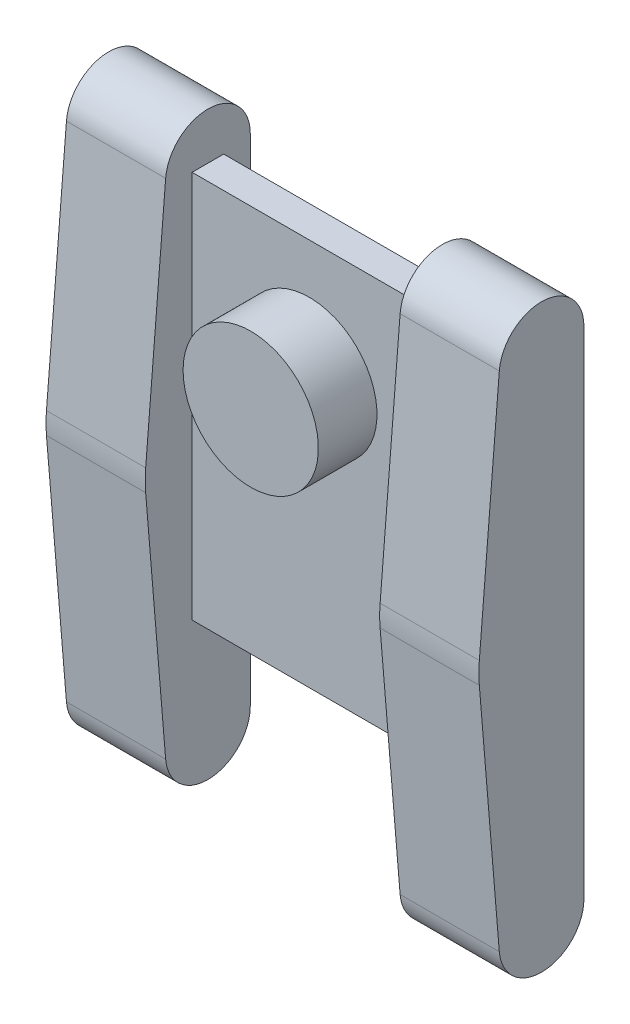
ISO-10303-21;
HEADER;
FILE_DESCRIPTION(('STEP AP214'),'2;1');
FILE_NAME('part.step','',(''),(''),'','','');
FILE_SCHEMA(('AUTOMOTIVE_DESIGN { 1 0 10303 214 1 1 1 1 }'));
ENDSEC;
DATA;
#1=APPLICATION_CONTEXT('core data for automotive mechanical design processes');
#2=APPLICATION_PROTOCOL_DEFINITION('international standard','automotive_design',2000,#1);
#3=PRODUCT_CONTEXT('',#1,'mechanical');
#4=PRODUCT('Part','Part','',(#3));
#5=PRODUCT_RELATED_PRODUCT_CATEGORY('part','',(#4));
#6=PRODUCT_DEFINITION_FORMATION('','',#4);
#7=PRODUCT_DEFINITION_CONTEXT('part definition',#1,'design');
#8=PRODUCT_DEFINITION('design','',#6,#7);
#9=PRODUCT_DEFINITION_SHAPE('','',#8);
#10=(LENGTH_UNIT() NAMED_UNIT(*) SI_UNIT(.MILLI.,.METRE.));
#11=(NAMED_UNIT(*) PLANE_ANGLE_UNIT() SI_UNIT($,.RADIAN.));
#12=(NAMED_UNIT(*) SI_UNIT($,.STERADIAN.) SOLID_ANGLE_UNIT());
#13=UNCERTAINTY_MEASURE_WITH_UNIT(LENGTH_MEASURE(1.E-05),#10,'distance_accuracy_value','');
#14=(GEOMETRIC_REPRESENTATION_CONTEXT(3) GLOBAL_UNCERTAINTY_ASSIGNED_CONTEXT((#13)) GLOBAL_UNIT_ASSIGNED_CONTEXT((#10,
#11,#12)) REPRESENTATION_CONTEXT('',''));
#15=CARTESIAN_POINT('',(0.,0.,0.));
#16=DIRECTION('',(0.,0.,1.));
#17=DIRECTION('',(1.,0.,0.));
#18=AXIS2_PLACEMENT_3D('',#15,#16,#17);
#19=CARTESIAN_POINT('',(2750.,-1600.,-450.));
#20=DIRECTION('',(0.,0.,1.));
#21=DIRECTION('',(1.,0.,0.));
#22=AXIS2_PLACEMENT_3D('',#19,#20,#21);
#23=PLANE('',#22);
#24=CARTESIAN_POINT('',(2000.,-1600.,-450.));
#25=DIRECTION('',(0.,0.,-1.));
#26=DIRECTION('',(-1.,0.,0.));
#27=AXIS2_PLACEMENT_3D('',#24,#25,#26);
#28=CIRCLE('',#27,750.);
#29=CARTESIAN_POINT('',(1250.,-1600.,-450.));
#30=VERTEX_POINT('',#29);
#31=EDGE_CURVE('E19',#30,#30,#28,.T.);
#32=ORIENTED_EDGE('',*,*,#31,.F.);
#33=EDGE_LOOP('',(#32));
#34=FACE_BOUND('',#33,.T.);
#35=ADVANCED_FACE('F16',(#34),#23,.T.);
#36=CARTESIAN_POINT('',(4400.,-250.,-1275.));
#37=DIRECTION('',(-1.,0.,0.));
#38=DIRECTION('',(0.,0.,1.));
#39=AXIS2_PLACEMENT_3D('',#36,#37,#38);
#40=PLANE('',#39);
#41=CARTESIAN_POINT('',(4400.,-3000.00000000002,-2025.00000000002));
#42=DIRECTION('',(-1.,0.,0.));
#43=DIRECTION('',(0.,0.,1.));
#44=AXIS2_PLACEMENT_3D('',#41,#42,#43);
#45=CIRCLE('',#44,1445.00000000002);
#46=CARTESIAN_POINT('',(4400.,-3119.57899022863,-584.956297504861));
#47=VERTEX_POINT('',#46);
#48=CARTESIAN_POINT('',(4400.,-2880.42100977142,-584.95629750486));
#49=VERTEX_POINT('',#48);
#50=EDGE_CURVE('E126',#47,#49,#45,.T.);
#51=ORIENTED_EDGE('',*,*,#50,.F.);
#52=DIRECTION('',(0.,-0.996570036328816,-0.082753626455778));
#53=VECTOR('',#52,1.);
#54=CARTESIAN_POINT('',(4400.,-5788.89420443421,-806.612082925455));
#55=LINE('',#54,#53);
#56=CARTESIAN_POINT('',(4400.,-5788.89420443421,-806.612082925456));
#57=VERTEX_POINT('',#56);
#58=EDGE_CURVE('E132',#57,#47,#55,.F.);
#59=ORIENTED_EDGE('',*,*,#58,.F.);
#60=CARTESIAN_POINT('',(4400.,-5750.,-1275.));
#61=DIRECTION('',(-1.,0.,0.));
#62=DIRECTION('',(0.,0.,1.));
#63=AXIS2_PLACEMENT_3D('',#60,#61,#62);
#64=CIRCLE('',#63,470.000000000001);
#65=CARTESIAN_POINT('',(4400.,-5750.,-1745.));
#66=VERTEX_POINT('',#65);
#67=EDGE_CURVE('E208',#66,#57,#64,.T.);
#68=ORIENTED_EDGE('',*,*,#67,.F.);
#69=DIRECTION('',(0.,1.,0.));
#70=VECTOR('',#69,1.);
#71=CARTESIAN_POINT('',(4400.,-250.,-1745.));
#72=LINE('',#71,#70);
#73=CARTESIAN_POINT('',(4400.,-250.,-1745.));
#74=VERTEX_POINT('',#73);
#75=EDGE_CURVE('E165',#74,#66,#72,.F.);
#76=ORIENTED_EDGE('',*,*,#75,.F.);
#77=CARTESIAN_POINT('',(4400.,-250.,-1275.));
#78=DIRECTION('',(-1.,0.,0.));
#79=DIRECTION('',(0.,0.,1.));
#80=AXIS2_PLACEMENT_3D('',#77,#78,#79);
#81=CIRCLE('',#80,470.);
#82=CARTESIAN_POINT('',(4400.,-211.105795565785,-806.612082925456));
#83=VERTEX_POINT('',#82);
#84=EDGE_CURVE('E210',#83,#74,#81,.T.);
#85=ORIENTED_EDGE('',*,*,#84,.F.);
#86=DIRECTION('',(0.,-0.996570036328816,0.0827536264557768));
#87=VECTOR('',#86,1.);
#88=CARTESIAN_POINT('',(4400.,-3000.00000000002,-575.026644064957));
#89=LINE('',#88,#87);
#90=EDGE_CURVE('E135',#49,#83,#89,.F.);
#91=ORIENTED_EDGE('',*,*,#90,.F.);
#92=EDGE_LOOP('',(#51,#59,#68,#76,#85,#91));
#93=FACE_BOUND('',#92,.T.);
#94=ADVANCED_FACE('F130',(#93),#40,.F.);
#95=CARTESIAN_POINT('',(-400.,-250.,-1275.));
#96=DIRECTION('',(1.,0.,0.));
#97=DIRECTION('',(0.,0.,-1.));
#98=AXIS2_PLACEMENT_3D('',#95,#96,#97);
#99=PLANE('',#98);
#100=CARTESIAN_POINT('',(-400.,-2999.99999999997,-2025.00000000002));
#101=DIRECTION('',(-1.,0.,0.));
#102=DIRECTION('',(0.,0.,1.));
#103=AXIS2_PLACEMENT_3D('',#100,#101,#102);
#104=CIRCLE('',#103,1445.00000000002);
#105=CARTESIAN_POINT('',(-400.,-2880.42100977137,-584.95629750486));
#106=VERTEX_POINT('',#105);
#107=CARTESIAN_POINT('',(-400.,-3119.57899022857,-584.95629750486));
#108=VERTEX_POINT('',#107);
#109=EDGE_CURVE('E163',#106,#108,#104,.F.);
#110=ORIENTED_EDGE('',*,*,#109,.F.);
#111=DIRECTION('',(0.,0.996570036328816,-0.0827536264557781));
#112=VECTOR('',#111,1.);
#113=CARTESIAN_POINT('',(-400.,-211.105795565784,-806.612082925455));
#114=LINE('',#113,#112);
#115=CARTESIAN_POINT('',(-400.,-211.105795565784,-806.612082925456));
#116=VERTEX_POINT('',#115);
#117=EDGE_CURVE('E154',#106,#116,#114,.T.);
#118=ORIENTED_EDGE('',*,*,#117,.T.);
#119=CARTESIAN_POINT('',(-400.,-250.,-1275.));
#120=DIRECTION('',(1.,0.,0.));
#121=DIRECTION('',(0.,0.,-1.));
#122=AXIS2_PLACEMENT_3D('',#119,#120,#121);
#123=CIRCLE('',#122,470.000000000001);
#124=CARTESIAN_POINT('',(-400.,-250.,-1745.));
#125=VERTEX_POINT('',#124);
#126=EDGE_CURVE('E199',#125,#116,#123,.T.);
#127=ORIENTED_EDGE('',*,*,#126,.F.);
#128=DIRECTION('',(0.,1.,0.));
#129=VECTOR('',#128,1.);
#130=CARTESIAN_POINT('',(-400.,0.,-1745.));
#131=LINE('',#130,#129);
#132=CARTESIAN_POINT('',(-400.,-5750.,-1745.));
#133=VERTEX_POINT('',#132);
#134=EDGE_CURVE('E157',#125,#133,#131,.F.);
#135=ORIENTED_EDGE('',*,*,#134,.T.);
#136=CARTESIAN_POINT('',(-400.,-5750.,-1275.));
#137=DIRECTION('',(1.,0.,0.));
#138=DIRECTION('',(0.,0.,-1.));
#139=AXIS2_PLACEMENT_3D('',#136,#137,#138);
#140=CIRCLE('',#139,470.000000000001);
#141=CARTESIAN_POINT('',(-400.,-5788.89420443422,-806.612082925455));
#142=VERTEX_POINT('',#141);
#143=EDGE_CURVE('E160',#142,#133,#140,.T.);
#144=ORIENTED_EDGE('',*,*,#143,.F.);
#145=DIRECTION('',(0.,0.996570036328816,0.0827536264557765));
#146=VECTOR('',#145,1.);
#147=CARTESIAN_POINT('',(-400.,-2999.99999999997,-575.026644064957));
#148=LINE('',#147,#146);
#149=EDGE_CURVE('E161',#142,#108,#148,.T.);
#150=ORIENTED_EDGE('',*,*,#149,.T.);
#151=EDGE_LOOP('',(#110,#118,#127,#135,#144,#150));
#152=FACE_BOUND('',#151,.T.);
#153=ADVANCED_FACE('F348',(#152),#99,.F.);
#154=CARTESIAN_POINT('',(2000.,-1600.,-450.));
#155=DIRECTION('',(0.,0.,-1.));
#156=DIRECTION('',(-1.,0.,0.));
#157=AXIS2_PLACEMENT_3D('',#154,#155,#156);
#158=CYLINDRICAL_SURFACE('',#157,750.);
#159=CARTESIAN_POINT('',(2000.,-1600.,-1100.));
#160=DIRECTION('',(0.,0.,-1.));
#161=DIRECTION('',(-1.,0.,0.));
#162=AXIS2_PLACEMENT_3D('',#159,#160,#161);
#163=CIRCLE('',#162,750.);
#164=CARTESIAN_POINT('',(1250.,-1600.,-1100.));
#165=VERTEX_POINT('',#164);
#166=EDGE_CURVE('E195',#165,#165,#163,.T.);
#167=ORIENTED_EDGE('',*,*,#166,.F.);
#168=EDGE_LOOP('',(#167));
#169=FACE_BOUND('',#168,.T.);
#170=ORIENTED_EDGE('',*,*,#31,.T.);
#171=EDGE_LOOP('',(#170));
#172=FACE_BOUND('',#171,.T.);
#173=ADVANCED_FACE('F353',(#169,#172),#158,.T.);
#174=CARTESIAN_POINT('',(4400.,-5788.89420443421,-806.612082925455));
#175=DIRECTION('',(0.,-0.082753626455778,0.996570036328816));
#176=DIRECTION('',(0.,-0.996570036328816,-0.082753626455778));
#177=AXIS2_PLACEMENT_3D('',#174,#175,#176);
#178=PLANE('',#177);
#179=DIRECTION('',(0.,0.996570036328816,0.0827536264557782));
#180=VECTOR('',#179,1.);
#181=CARTESIAN_POINT('',(3300.,-5788.89420443421,-806.612082925456));
#182=LINE('',#181,#180);
#183=CARTESIAN_POINT('',(3300.,-5788.89420443421,-806.612082925456));
#184=VERTEX_POINT('',#183);
#185=CARTESIAN_POINT('',(3300.,-3119.57899022863,-584.956297504861));
#186=VERTEX_POINT('',#185);
#187=EDGE_CURVE('E194',#184,#186,#182,.T.);
#188=ORIENTED_EDGE('',*,*,#187,.F.);
#189=DIRECTION('',(-1.,0.,0.));
#190=VECTOR('',#189,1.);
#191=CARTESIAN_POINT('',(4400.,-5788.89420443421,-806.612082925456));
#192=LINE('',#191,#190);
#193=EDGE_CURVE('E144',#57,#184,#192,.T.);
#194=ORIENTED_EDGE('',*,*,#193,.F.);
#195=ORIENTED_EDGE('',*,*,#58,.T.);
#196=DIRECTION('',(-1.,0.,0.));
#197=VECTOR('',#196,1.);
#198=CARTESIAN_POINT('',(4400.,-3119.57899022863,-584.956297504861));
#199=LINE('',#198,#197);
#200=EDGE_CURVE('E138',#186,#47,#199,.F.);
#201=ORIENTED_EDGE('',*,*,#200,.F.);
#202=EDGE_LOOP('',(#188,#194,#195,#201));
#203=FACE_BOUND('',#202,.T.);
#204=ADVANCED_FACE('F141',(#203),#178,.T.);
#205=CARTESIAN_POINT('',(4400.,-3000.00000000002,-2025.00000000002));
#206=DIRECTION('',(-1.,0.,0.));
#207=DIRECTION('',(0.,0.,1.));
#208=AXIS2_PLACEMENT_3D('',#205,#206,#207);
#209=CYLINDRICAL_SURFACE('',#208,1445.00000000002);
#210=DIRECTION('',(1.,0.,0.));
#211=VECTOR('',#210,1.);
#212=CARTESIAN_POINT('',(4400.,-2880.42100977142,-584.95629750486));
#213=LINE('',#212,#211);
#214=CARTESIAN_POINT('',(3300.,-2880.42100977142,-584.95629750486));
#215=VERTEX_POINT('',#214);
#216=EDGE_CURVE('E137',#215,#49,#213,.T.);
#217=ORIENTED_EDGE('',*,*,#216,.F.);
#218=CARTESIAN_POINT('',(3300.,-3000.00000000002,-2025.00000000002));
#219=DIRECTION('',(-1.,0.,0.));
#220=DIRECTION('',(0.,0.,1.));
#221=AXIS2_PLACEMENT_3D('',#218,#219,#220);
#222=CIRCLE('',#221,1445.00000000002);
#223=EDGE_CURVE('E149',#186,#215,#222,.T.);
#224=ORIENTED_EDGE('',*,*,#223,.F.);
#225=ORIENTED_EDGE('',*,*,#200,.T.);
#226=ORIENTED_EDGE('',*,*,#50,.T.);
#227=EDGE_LOOP('',(#217,#224,#225,#226));
#228=FACE_BOUND('',#227,.T.);
#229=ADVANCED_FACE('F147',(#228),#209,.T.);
#230=CARTESIAN_POINT('',(4400.,-3000.00000000002,-575.026644064957));
#231=DIRECTION('',(0.,0.0827536264557768,0.996570036328816));
#232=DIRECTION('',(0.,-0.996570036328816,0.0827536264557768));
#233=AXIS2_PLACEMENT_3D('',#230,#231,#232);
#234=PLANE('',#233);
#235=ORIENTED_EDGE('',*,*,#90,.T.);
#236=DIRECTION('',(-1.,0.,0.));
#237=VECTOR('',#236,1.);
#238=CARTESIAN_POINT('',(4400.,-211.105795565784,-806.612082925456));
#239=LINE('',#238,#237);
#240=CARTESIAN_POINT('',(3300.,-211.105795565785,-806.612082925456));
#241=VERTEX_POINT('',#240);
#242=EDGE_CURVE('E170',#241,#83,#239,.F.);
#243=ORIENTED_EDGE('',*,*,#242,.F.);
#244=DIRECTION('',(0.,0.996570036328816,-0.0827536264557768));
#245=VECTOR('',#244,1.);
#246=CARTESIAN_POINT('',(3300.,-2880.42100977142,-584.95629750486));
#247=LINE('',#246,#245);
#248=EDGE_CURVE('E192',#215,#241,#247,.T.);
#249=ORIENTED_EDGE('',*,*,#248,.F.);
#250=ORIENTED_EDGE('',*,*,#216,.T.);
#251=EDGE_LOOP('',(#235,#243,#249,#250));
#252=FACE_BOUND('',#251,.T.);
#253=ADVANCED_FACE('F366',(#252),#234,.T.);
#254=CARTESIAN_POINT('',(4400.,-250.,-1275.));
#255=DIRECTION('',(-1.,0.,0.));
#256=DIRECTION('',(0.,0.,1.));
#257=AXIS2_PLACEMENT_3D('',#254,#255,#256);
#258=CYLINDRICAL_SURFACE('',#257,470.);
#259=ORIENTED_EDGE('',*,*,#84,.T.);
#260=DIRECTION('',(1.,0.,0.));
#261=VECTOR('',#260,1.);
#262=CARTESIAN_POINT('',(4400.,-250.,-1745.));
#263=LINE('',#262,#261);
#264=CARTESIAN_POINT('',(3300.,-250.,-1745.));
#265=VERTEX_POINT('',#264);
#266=EDGE_CURVE('E168',#265,#74,#263,.T.);
#267=ORIENTED_EDGE('',*,*,#266,.F.);
#268=CARTESIAN_POINT('',(3300.,-250.,-1275.));
#269=DIRECTION('',(-1.,0.,0.));
#270=DIRECTION('',(0.,0.,1.));
#271=AXIS2_PLACEMENT_3D('',#268,#269,#270);
#272=CIRCLE('',#271,470.);
#273=EDGE_CURVE('E189',#241,#265,#272,.T.);
#274=ORIENTED_EDGE('',*,*,#273,.F.);
#275=ORIENTED_EDGE('',*,*,#242,.T.);
#276=EDGE_LOOP('',(#259,#267,#274,#275));
#277=FACE_BOUND('',#276,.T.);
#278=ADVANCED_FACE('F304',(#277),#258,.T.);
#279=CARTESIAN_POINT('',(4400.,-250.,-1745.));
#280=DIRECTION('',(0.,0.,-1.));
#281=DIRECTION('',(0.,1.,0.));
#282=AXIS2_PLACEMENT_3D('',#279,#280,#281);
#283=PLANE('',#282);
#284=ORIENTED_EDGE('',*,*,#75,.T.);
#285=DIRECTION('',(-1.,0.,0.));
#286=VECTOR('',#285,1.);
#287=CARTESIAN_POINT('',(4400.,-5750.,-1745.));
#288=LINE('',#287,#286);
#289=CARTESIAN_POINT('',(3300.,-5750.,-1745.));
#290=VERTEX_POINT('',#289);
#291=EDGE_CURVE('E167',#290,#66,#288,.F.);
#292=ORIENTED_EDGE('',*,*,#291,.F.);
#293=DIRECTION('',(0.,1.,0.));
#294=VECTOR('',#293,1.);
#295=CARTESIAN_POINT('',(3300.,-250.,-1745.));
#296=LINE('',#295,#294);
#297=EDGE_CURVE('E188',#265,#290,#296,.F.);
#298=ORIENTED_EDGE('',*,*,#297,.F.);
#299=ORIENTED_EDGE('',*,*,#266,.T.);
#300=EDGE_LOOP('',(#284,#292,#298,#299));
#301=FACE_BOUND('',#300,.T.);
#302=ADVANCED_FACE('F290',(#301),#283,.T.);
#303=CARTESIAN_POINT('',(4400.,-5750.,-1275.));
#304=DIRECTION('',(-1.,0.,0.));
#305=DIRECTION('',(0.,0.,1.));
#306=AXIS2_PLACEMENT_3D('',#303,#304,#305);
#307=CYLINDRICAL_SURFACE('',#306,470.000000000001);
#308=ORIENTED_EDGE('',*,*,#67,.T.);
#309=ORIENTED_EDGE('',*,*,#193,.T.);
#310=CARTESIAN_POINT('',(3300.,-5750.,-1275.));
#311=DIRECTION('',(-1.,0.,0.));
#312=DIRECTION('',(0.,0.,1.));
#313=AXIS2_PLACEMENT_3D('',#310,#311,#312);
#314=CIRCLE('',#313,470.000000000001);
#315=EDGE_CURVE('E184',#290,#184,#314,.T.);
#316=ORIENTED_EDGE('',*,*,#315,.F.);
#317=ORIENTED_EDGE('',*,*,#291,.T.);
#318=EDGE_LOOP('',(#308,#309,#316,#317));
#319=FACE_BOUND('',#318,.T.);
#320=ADVANCED_FACE('F292',(#319),#307,.T.);
#321=CARTESIAN_POINT('',(700.,-211.105795565784,-806.612082925455));
#322=DIRECTION('',(0.,-0.0827536264557781,-0.996570036328816));
#323=DIRECTION('',(0.,0.996570036328816,-0.0827536264557781));
#324=AXIS2_PLACEMENT_3D('',#321,#322,#323);
#325=PLANE('',#324);
#326=DIRECTION('',(-1.,0.,0.));
#327=VECTOR('',#326,1.);
#328=CARTESIAN_POINT('',(700.,-2880.42100977137,-584.95629750486));
#329=LINE('',#328,#327);
#330=CARTESIAN_POINT('',(700.,-2880.42100977137,-584.95629750486));
#331=VERTEX_POINT('',#330);
#332=EDGE_CURVE('E156',#331,#106,#329,.T.);
#333=ORIENTED_EDGE('',*,*,#332,.F.);
#334=DIRECTION('',(0.,-0.996570036328816,0.0827536264557783));
#335=VECTOR('',#334,1.);
#336=CARTESIAN_POINT('',(700.,-211.105795565784,-806.612082925456));
#337=LINE('',#336,#335);
#338=CARTESIAN_POINT('',(700.,-211.105795565784,-806.612082925456));
#339=VERTEX_POINT('',#338);
#340=EDGE_CURVE('E183',#339,#331,#337,.T.);
#341=ORIENTED_EDGE('',*,*,#340,.F.);
#342=DIRECTION('',(1.,0.,0.));
#343=VECTOR('',#342,1.);
#344=CARTESIAN_POINT('',(-400.,-211.105795565784,-806.612082925456));
#345=LINE('',#344,#343);
#346=EDGE_CURVE('E198',#116,#339,#345,.T.);
#347=ORIENTED_EDGE('',*,*,#346,.F.);
#348=ORIENTED_EDGE('',*,*,#117,.F.);
#349=EDGE_LOOP('',(#333,#341,#347,#348));
#350=FACE_BOUND('',#349,.T.);
#351=ADVANCED_FACE('F294',(#350),#325,.F.);
#352=CARTESIAN_POINT('',(700.,-2999.99999999997,-2025.00000000002));
#353=DIRECTION('',(-1.,0.,0.));
#354=DIRECTION('',(0.,0.,1.));
#355=AXIS2_PLACEMENT_3D('',#352,#353,#354);
#356=CYLINDRICAL_SURFACE('',#355,1445.00000000002);
#357=ORIENTED_EDGE('',*,*,#109,.T.);
#358=DIRECTION('',(1.,0.,0.));
#359=VECTOR('',#358,1.);
#360=CARTESIAN_POINT('',(700.,-3119.57899022857,-584.95629750486));
#361=LINE('',#360,#359);
#362=CARTESIAN_POINT('',(700.,-3119.57899022857,-584.95629750486));
#363=VERTEX_POINT('',#362);
#364=EDGE_CURVE('E162',#108,#363,#361,.T.);
#365=ORIENTED_EDGE('',*,*,#364,.T.);
#366=CARTESIAN_POINT('',(700.,-2999.99999999997,-2025.00000000002));
#367=DIRECTION('',(-1.,0.,0.));
#368=DIRECTION('',(0.,0.,1.));
#369=AXIS2_PLACEMENT_3D('',#366,#367,#368);
#370=CIRCLE('',#369,1445.00000000002);
#371=EDGE_CURVE('E180',#331,#363,#370,.F.);
#372=ORIENTED_EDGE('',*,*,#371,.F.);
#373=ORIENTED_EDGE('',*,*,#332,.T.);
#374=EDGE_LOOP('',(#357,#365,#372,#373));
#375=FACE_BOUND('',#374,.T.);
#376=ADVANCED_FACE('F301',(#375),#356,.T.);
#377=CARTESIAN_POINT('',(700.,-2999.99999999997,-575.026644064957));
#378=DIRECTION('',(0.,0.0827536264557765,-0.996570036328816));
#379=DIRECTION('',(0.,0.996570036328816,0.0827536264557765));
#380=AXIS2_PLACEMENT_3D('',#377,#378,#379);
#381=PLANE('',#380);
#382=ORIENTED_EDGE('',*,*,#364,.F.);
#383=ORIENTED_EDGE('',*,*,#149,.F.);
#384=DIRECTION('',(1.,0.,0.));
#385=VECTOR('',#384,1.);
#386=CARTESIAN_POINT('',(-400.,-5788.89420443422,-806.612082925456));
#387=LINE('',#386,#385);
#388=CARTESIAN_POINT('',(700.,-5788.89420443422,-806.612082925455));
#389=VERTEX_POINT('',#388);
#390=EDGE_CURVE('E205',#389,#142,#387,.F.);
#391=ORIENTED_EDGE('',*,*,#390,.F.);
#392=DIRECTION('',(0.,-0.996570036328816,-0.0827536264557764));
#393=VECTOR('',#392,1.);
#394=CARTESIAN_POINT('',(700.,-3119.57899022857,-584.95629750486));
#395=LINE('',#394,#393);
#396=EDGE_CURVE('E179',#363,#389,#395,.T.);
#397=ORIENTED_EDGE('',*,*,#396,.F.);
#398=EDGE_LOOP('',(#382,#383,#391,#397));
#399=FACE_BOUND('',#398,.T.);
#400=ADVANCED_FACE('F330',(#399),#381,.F.);
#401=CARTESIAN_POINT('',(-400.,-5750.,-1275.));
#402=DIRECTION('',(1.,0.,0.));
#403=DIRECTION('',(0.,0.,-1.));
#404=AXIS2_PLACEMENT_3D('',#401,#402,#403);
#405=CYLINDRICAL_SURFACE('',#404,470.000000000001);
#406=ORIENTED_EDGE('',*,*,#143,.T.);
#407=DIRECTION('',(1.,0.,0.));
#408=VECTOR('',#407,1.);
#409=CARTESIAN_POINT('',(0.,-5750.,-1745.));
#410=LINE('',#409,#408);
#411=CARTESIAN_POINT('',(700.,-5750.,-1745.));
#412=VERTEX_POINT('',#411);
#413=EDGE_CURVE('E159',#133,#412,#410,.T.);
#414=ORIENTED_EDGE('',*,*,#413,.T.);
#415=CARTESIAN_POINT('',(700.,-5750.,-1275.));
#416=DIRECTION('',(1.,0.,0.));
#417=DIRECTION('',(0.,0.,-1.));
#418=AXIS2_PLACEMENT_3D('',#415,#416,#417);
#419=CIRCLE('',#418,470.000000000001);
#420=EDGE_CURVE('E176',#389,#412,#419,.T.);
#421=ORIENTED_EDGE('',*,*,#420,.F.);
#422=ORIENTED_EDGE('',*,*,#390,.T.);
#423=EDGE_LOOP('',(#406,#414,#421,#422));
#424=FACE_BOUND('',#423,.T.);
#425=ADVANCED_FACE('F326',(#424),#405,.T.);
#426=CARTESIAN_POINT('',(0.,0.,-1745.));
#427=DIRECTION('',(0.,0.,1.));
#428=DIRECTION('',(1.,0.,0.));
#429=AXIS2_PLACEMENT_3D('',#426,#427,#428);
#430=PLANE('',#429);
#431=ORIENTED_EDGE('',*,*,#413,.F.);
#432=ORIENTED_EDGE('',*,*,#134,.F.);
#433=DIRECTION('',(1.,0.,0.));
#434=VECTOR('',#433,1.);
#435=CARTESIAN_POINT('',(-400.,-250.,-1745.));
#436=LINE('',#435,#434);
#437=CARTESIAN_POINT('',(700.,-250.,-1745.));
#438=VERTEX_POINT('',#437);
#439=EDGE_CURVE('E202',#438,#125,#436,.F.);
#440=ORIENTED_EDGE('',*,*,#439,.F.);
#441=DIRECTION('',(0.,1.,0.));
#442=VECTOR('',#441,1.);
#443=CARTESIAN_POINT('',(700.,-250.,-1745.));
#444=LINE('',#443,#442);
#445=EDGE_CURVE('E175',#412,#438,#444,.T.);
#446=ORIENTED_EDGE('',*,*,#445,.F.);
#447=EDGE_LOOP('',(#431,#432,#440,#446));
#448=FACE_BOUND('',#447,.T.);
#449=ADVANCED_FACE('F322',(#448),#430,.F.);
#450=CARTESIAN_POINT('',(-400.,-250.,-1275.));
#451=DIRECTION('',(1.,0.,0.));
#452=DIRECTION('',(0.,0.,-1.));
#453=AXIS2_PLACEMENT_3D('',#450,#451,#452);
#454=CYLINDRICAL_SURFACE('',#453,470.000000000001);
#455=ORIENTED_EDGE('',*,*,#126,.T.);
#456=ORIENTED_EDGE('',*,*,#346,.T.);
#457=CARTESIAN_POINT('',(700.,-250.,-1275.));
#458=DIRECTION('',(1.,0.,0.));
#459=DIRECTION('',(0.,0.,-1.));
#460=AXIS2_PLACEMENT_3D('',#457,#458,#459);
#461=CIRCLE('',#460,470.000000000001);
#462=EDGE_CURVE('E171',#438,#339,#461,.T.);
#463=ORIENTED_EDGE('',*,*,#462,.F.);
#464=ORIENTED_EDGE('',*,*,#439,.T.);
#465=EDGE_LOOP('',(#455,#456,#463,#464));
#466=FACE_BOUND('',#465,.T.);
#467=ADVANCED_FACE('F319',(#466),#454,.T.);
#468=CARTESIAN_POINT('',(0.,0.,-1100.));
#469=DIRECTION('',(0.,0.,1.));
#470=DIRECTION('',(1.,0.,0.));
#471=AXIS2_PLACEMENT_3D('',#468,#469,#470);
#472=PLANE('',#471);
#473=DIRECTION('',(0.,1.,0.));
#474=VECTOR('',#473,1.);
#475=CARTESIAN_POINT('',(3300.,-250.,-1100.));
#476=LINE('',#475,#474);
#477=CARTESIAN_POINT('',(3300.,-300.,-1100.));
#478=VERTEX_POINT('',#477);
#479=CARTESIAN_POINT('',(3300.,-4600.,-1100.));
#480=VERTEX_POINT('',#479);
#481=EDGE_CURVE('E187',#478,#480,#476,.F.);
#482=ORIENTED_EDGE('',*,*,#481,.F.);
#483=DIRECTION('',(1.,0.,0.));
#484=VECTOR('',#483,1.);
#485=CARTESIAN_POINT('',(0.,-300.,-1100.));
#486=LINE('',#485,#484);
#487=CARTESIAN_POINT('',(700.,-300.,-1100.));
#488=VERTEX_POINT('',#487);
#489=EDGE_CURVE('E254',#488,#478,#486,.T.);
#490=ORIENTED_EDGE('',*,*,#489,.F.);
#491=DIRECTION('',(0.,1.,0.));
#492=VECTOR('',#491,1.);
#493=CARTESIAN_POINT('',(700.,-250.,-1100.));
#494=LINE('',#493,#492);
#495=CARTESIAN_POINT('',(700.,-4600.,-1100.));
#496=VERTEX_POINT('',#495);
#497=EDGE_CURVE('E174',#496,#488,#494,.T.);
#498=ORIENTED_EDGE('',*,*,#497,.F.);
#499=DIRECTION('',(1.,0.,0.));
#500=VECTOR('',#499,1.);
#501=CARTESIAN_POINT('',(0.,-4600.,-1100.));
#502=LINE('',#501,#500);
#503=EDGE_CURVE('E240',#480,#496,#502,.F.);
#504=ORIENTED_EDGE('',*,*,#503,.F.);
#505=EDGE_LOOP('',(#482,#490,#498,#504));
#506=FACE_BOUND('',#505,.T.);
#507=ORIENTED_EDGE('',*,*,#166,.T.);
#508=EDGE_LOOP('',(#507));
#509=FACE_BOUND('',#508,.T.);
#510=ADVANCED_FACE('F277',(#506,#509),#472,.T.);
#511=CARTESIAN_POINT('',(3300.,-250.,-1275.));
#512=DIRECTION('',(-1.,0.,0.));
#513=DIRECTION('',(0.,0.,1.));
#514=AXIS2_PLACEMENT_3D('',#511,#512,#513);
#515=PLANE('',#514);
#516=DIRECTION('',(0.,0.,-1.));
#517=VECTOR('',#516,1.);
#518=CARTESIAN_POINT('',(3300.,-4600.,0.));
#519=LINE('',#518,#517);
#520=CARTESIAN_POINT('',(3300.,-4600.,-1450.));
#521=VERTEX_POINT('',#520);
#522=EDGE_CURVE('E237',#521,#480,#519,.F.);
#523=ORIENTED_EDGE('',*,*,#522,.F.);
#524=DIRECTION('',(0.,1.,0.));
#525=VECTOR('',#524,1.);
#526=CARTESIAN_POINT('',(3300.,0.,-1450.));
#527=LINE('',#526,#525);
#528=CARTESIAN_POINT('',(3300.,-300.,-1450.));
#529=VERTEX_POINT('',#528);
#530=EDGE_CURVE('E260',#529,#521,#527,.F.);
#531=ORIENTED_EDGE('',*,*,#530,.F.);
#532=DIRECTION('',(0.,0.,1.));
#533=VECTOR('',#532,1.);
#534=CARTESIAN_POINT('',(3300.,-300.,0.));
#535=LINE('',#534,#533);
#536=EDGE_CURVE('E257',#478,#529,#535,.F.);
#537=ORIENTED_EDGE('',*,*,#536,.F.);
#538=ORIENTED_EDGE('',*,*,#481,.T.);
#539=EDGE_LOOP('',(#523,#531,#537,#538));
#540=FACE_BOUND('',#539,.T.);
#541=ORIENTED_EDGE('',*,*,#297,.T.);
#542=ORIENTED_EDGE('',*,*,#315,.T.);
#543=ORIENTED_EDGE('',*,*,#187,.T.);
#544=ORIENTED_EDGE('',*,*,#223,.T.);
#545=ORIENTED_EDGE('',*,*,#248,.T.);
#546=ORIENTED_EDGE('',*,*,#273,.T.);
#547=EDGE_LOOP('',(#541,#542,#543,#544,#545,#546));
#548=FACE_BOUND('',#547,.T.);
#549=ADVANCED_FACE('F283',(#540,#548),#515,.T.);
#550=CARTESIAN_POINT('',(0.,-4600.,0.));
#551=DIRECTION('',(0.,-1.,0.));
#552=DIRECTION('',(0.,0.,-1.));
#553=AXIS2_PLACEMENT_3D('',#550,#551,#552);
#554=PLANE('',#553);
#555=DIRECTION('',(0.,0.,-1.));
#556=VECTOR('',#555,1.);
#557=CARTESIAN_POINT('',(700.,-4600.,-1275.));
#558=LINE('',#557,#556);
#559=CARTESIAN_POINT('',(700.,-4600.,-1450.));
#560=VERTEX_POINT('',#559);
#561=EDGE_CURVE('E250',#560,#496,#558,.F.);
#562=ORIENTED_EDGE('',*,*,#561,.F.);
#563=DIRECTION('',(-1.,0.,0.));
#564=VECTOR('',#563,1.);
#565=CARTESIAN_POINT('',(0.,-4600.,-1450.));
#566=LINE('',#565,#564);
#567=EDGE_CURVE('E263',#521,#560,#566,.T.);
#568=ORIENTED_EDGE('',*,*,#567,.F.);
#569=ORIENTED_EDGE('',*,*,#522,.T.);
#570=ORIENTED_EDGE('',*,*,#503,.T.);
#571=EDGE_LOOP('',(#562,#568,#569,#570));
#572=FACE_BOUND('',#571,.T.);
#573=ADVANCED_FACE('F274',(#572),#554,.T.);
#574=CARTESIAN_POINT('',(700.,-250.,-1275.));
#575=DIRECTION('',(1.,0.,0.));
#576=DIRECTION('',(0.,0.,-1.));
#577=AXIS2_PLACEMENT_3D('',#574,#575,#576);
#578=PLANE('',#577);
#579=DIRECTION('',(0.,1.,0.));
#580=VECTOR('',#579,1.);
#581=CARTESIAN_POINT('',(700.,0.,-1450.));
#582=LINE('',#581,#580);
#583=CARTESIAN_POINT('',(700.,-300.,-1450.));
#584=VERTEX_POINT('',#583);
#585=EDGE_CURVE('E25',#560,#584,#582,.T.);
#586=ORIENTED_EDGE('',*,*,#585,.F.);
#587=ORIENTED_EDGE('',*,*,#561,.T.);
#588=ORIENTED_EDGE('',*,*,#497,.T.);
#589=DIRECTION('',(0.,0.,1.));
#590=VECTOR('',#589,1.);
#591=CARTESIAN_POINT('',(700.,-300.,0.));
#592=LINE('',#591,#590);
#593=EDGE_CURVE('E34',#584,#488,#592,.T.);
#594=ORIENTED_EDGE('',*,*,#593,.F.);
#595=EDGE_LOOP('',(#586,#587,#588,#594));
#596=FACE_BOUND('',#595,.T.);
#597=ORIENTED_EDGE('',*,*,#445,.T.);
#598=ORIENTED_EDGE('',*,*,#462,.T.);
#599=ORIENTED_EDGE('',*,*,#340,.T.);
#600=ORIENTED_EDGE('',*,*,#371,.T.);
#601=ORIENTED_EDGE('',*,*,#396,.T.);
#602=ORIENTED_EDGE('',*,*,#420,.T.);
#603=EDGE_LOOP('',(#597,#598,#599,#600,#601,#602));
#604=FACE_BOUND('',#603,.T.);
#605=ADVANCED_FACE('F270',(#596,#604),#578,.T.);
#606=CARTESIAN_POINT('',(0.,-300.,0.));
#607=DIRECTION('',(0.,1.,0.));
#608=DIRECTION('',(0.,0.,1.));
#609=AXIS2_PLACEMENT_3D('',#606,#607,#608);
#610=PLANE('',#609);
#611=ORIENTED_EDGE('',*,*,#536,.T.);
#612=DIRECTION('',(-1.,0.,0.));
#613=VECTOR('',#612,1.);
#614=CARTESIAN_POINT('',(0.,-300.,-1450.));
#615=LINE('',#614,#613);
#616=EDGE_CURVE('E10',#584,#529,#615,.F.);
#617=ORIENTED_EDGE('',*,*,#616,.F.);
#618=ORIENTED_EDGE('',*,*,#593,.T.);
#619=ORIENTED_EDGE('',*,*,#489,.T.);
#620=EDGE_LOOP('',(#611,#617,#618,#619));
#621=FACE_BOUND('',#620,.T.);
#622=ADVANCED_FACE('F281',(#621),#610,.T.);
#623=CARTESIAN_POINT('',(0.,0.,-1450.));
#624=DIRECTION('',(0.,0.,-1.));
#625=DIRECTION('',(-1.,0.,0.));
#626=AXIS2_PLACEMENT_3D('',#623,#624,#625);
#627=PLANE('',#626);
#628=ORIENTED_EDGE('',*,*,#585,.T.);
#629=ORIENTED_EDGE('',*,*,#616,.T.);
#630=ORIENTED_EDGE('',*,*,#530,.T.);
#631=ORIENTED_EDGE('',*,*,#567,.T.);
#632=EDGE_LOOP('',(#628,#629,#630,#631));
#633=FACE_BOUND('',#632,.T.);
#634=ADVANCED_FACE('F268',(#633),#627,.T.);
#635=CLOSED_SHELL('',(#35,#94,#153,#173,#204,#229,#253,#278,#302,#320,#351,#376,#400,#425,#449,
#467,#510,#549,#573,#605,#622,#634));
#636=MANIFOLD_SOLID_BREP('B1',#635);
#637=ADVANCED_BREP_SHAPE_REPRESENTATION('',(#18,#636),#14);
#638=SHAPE_DEFINITION_REPRESENTATION(#9,#637);
ENDSEC;
END-ISO-10303-21;
